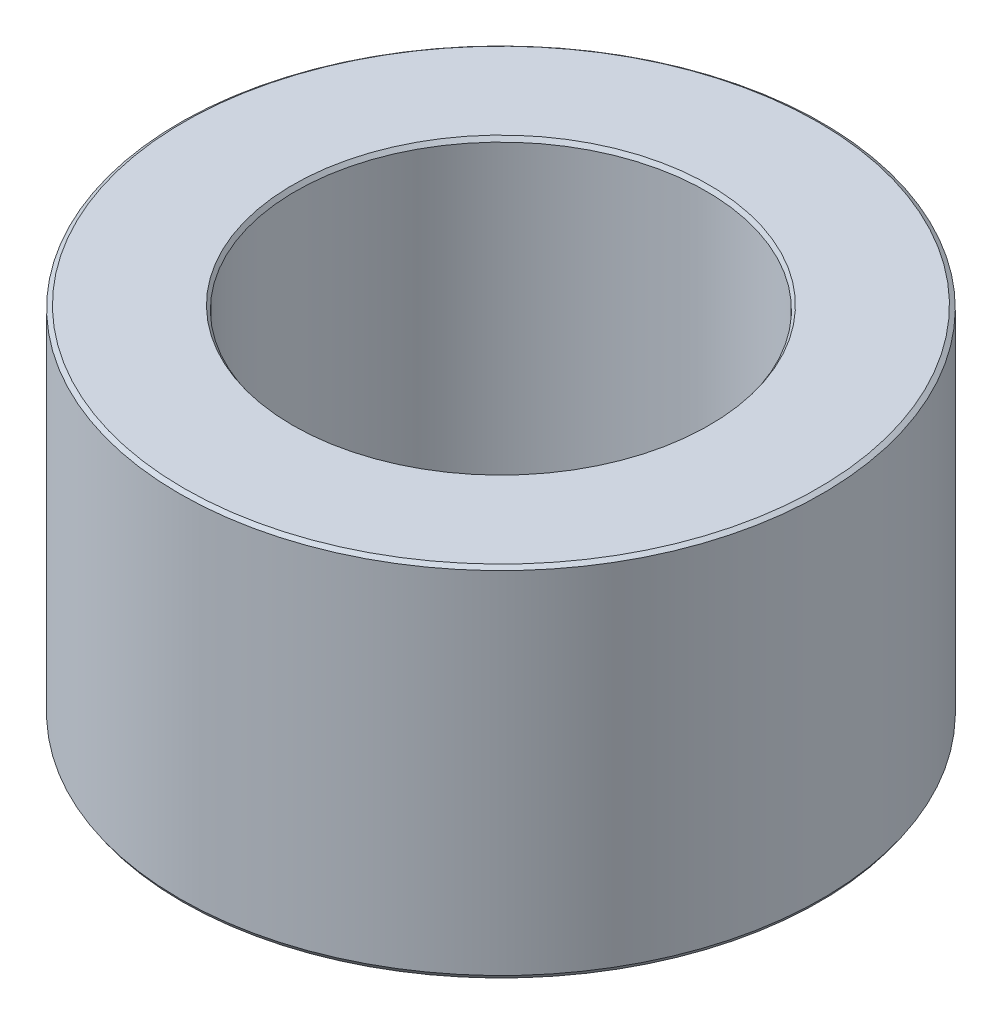
ISO-10303-21;
HEADER;
FILE_DESCRIPTION(('STEP AP214'),'2;1');
FILE_NAME('part.step','',(''),(''),'','','');
FILE_SCHEMA(('AUTOMOTIVE_DESIGN { 1 0 10303 214 1 1 1 1 }'));
ENDSEC;
DATA;
#1=APPLICATION_CONTEXT('core data for automotive mechanical design processes');
#2=APPLICATION_PROTOCOL_DEFINITION('international standard','automotive_design',2000,#1);
#3=PRODUCT_CONTEXT('',#1,'mechanical');
#4=PRODUCT('Part','Part','',(#3));
#5=PRODUCT_RELATED_PRODUCT_CATEGORY('part','',(#4));
#6=PRODUCT_DEFINITION_FORMATION('','',#4);
#7=PRODUCT_DEFINITION_CONTEXT('part definition',#1,'design');
#8=PRODUCT_DEFINITION('design','',#6,#7);
#9=PRODUCT_DEFINITION_SHAPE('','',#8);
#10=(LENGTH_UNIT() NAMED_UNIT(*) SI_UNIT(.MILLI.,.METRE.));
#11=(NAMED_UNIT(*) PLANE_ANGLE_UNIT() SI_UNIT($,.RADIAN.));
#12=(NAMED_UNIT(*) SI_UNIT($,.STERADIAN.) SOLID_ANGLE_UNIT());
#13=UNCERTAINTY_MEASURE_WITH_UNIT(LENGTH_MEASURE(1.E-05),#10,'distance_accuracy_value','');
#14=(GEOMETRIC_REPRESENTATION_CONTEXT(3) GLOBAL_UNCERTAINTY_ASSIGNED_CONTEXT((#13)) GLOBAL_UNIT_ASSIGNED_CONTEXT((#10,
#11,#12)) REPRESENTATION_CONTEXT('',''));
#15=CARTESIAN_POINT('',(0.,0.,0.));
#16=DIRECTION('',(0.,0.,1.));
#17=DIRECTION('',(1.,0.,0.));
#18=AXIS2_PLACEMENT_3D('',#15,#16,#17);
#19=CARTESIAN_POINT('',(0.,47.2960561947709,0.));
#20=DIRECTION('',(0.,-1.,0.));
#21=DIRECTION('',(0.,0.,-1.));
#22=AXIS2_PLACEMENT_3D('',#19,#20,#21);
#23=CYLINDRICAL_SURFACE('',#22,42.5);
#24=CARTESIAN_POINT('',(0.,0.544720812228144,0.));
#25=DIRECTION('',(0.,1.,0.));
#26=DIRECTION('',(0.,0.,1.));
#27=AXIS2_PLACEMENT_3D('',#24,#25,#26);
#28=CIRCLE('',#27,42.5);
#29=CARTESIAN_POINT('',(0.,0.544720812228144,42.5));
#30=VERTEX_POINT('',#29);
#31=EDGE_CURVE('E10',#30,#30,#28,.T.);
#32=ORIENTED_EDGE('',*,*,#31,.T.);
#33=EDGE_LOOP('',(#32));
#34=FACE_BOUND('',#33,.T.);
#35=CARTESIAN_POINT('',(0.,46.9309509189204,0.));
#36=DIRECTION('',(0.,1.,0.));
#37=DIRECTION('',(0.,0.,1.));
#38=AXIS2_PLACEMENT_3D('',#35,#36,#37);
#39=CIRCLE('',#38,42.5);
#40=CARTESIAN_POINT('',(0.,46.9309509189204,42.5));
#41=VERTEX_POINT('',#40);
#42=EDGE_CURVE('E50',#41,#41,#39,.F.);
#43=ORIENTED_EDGE('',*,*,#42,.T.);
#44=EDGE_LOOP('',(#43));
#45=FACE_BOUND('',#44,.T.);
#46=ADVANCED_FACE('F39',(#34,#45),#23,.T.);
#47=CARTESIAN_POINT('',(0.,47.2960561947709,0.));
#48=DIRECTION('',(0.,1.,0.));
#49=DIRECTION('',(0.,0.,1.));
#50=AXIS2_PLACEMENT_3D('',#47,#48,#49);
#51=PLANE('',#50);
#52=CARTESIAN_POINT('',(0.,47.2960561947709,0.));
#53=DIRECTION('',(0.,1.,0.));
#54=DIRECTION('',(0.,0.,1.));
#55=AXIS2_PLACEMENT_3D('',#52,#53,#54);
#56=CIRCLE('',#55,27.5468659009461);
#57=CARTESIAN_POINT('',(0.,47.2960561947709,27.5468659009461));
#58=VERTEX_POINT('',#57);
#59=EDGE_CURVE('E58',#58,#58,#56,.F.);
#60=ORIENTED_EDGE('',*,*,#59,.T.);
#61=EDGE_LOOP('',(#60));
#62=FACE_BOUND('',#61,.T.);
#63=CARTESIAN_POINT('',(0.,47.2960561947709,0.));
#64=DIRECTION('',(0.,1.,0.));
#65=DIRECTION('',(0.,0.,1.));
#66=AXIS2_PLACEMENT_3D('',#63,#64,#65);
#67=CIRCLE('',#66,41.9552791877718);
#68=CARTESIAN_POINT('',(0.,47.2960561947709,41.9552791877718));
#69=VERTEX_POINT('',#68);
#70=EDGE_CURVE('E61',#69,#69,#67,.T.);
#71=ORIENTED_EDGE('',*,*,#70,.T.);
#72=EDGE_LOOP('',(#71));
#73=FACE_BOUND('',#72,.T.);
#74=ADVANCED_FACE('F88',(#62,#73),#51,.T.);
#75=CARTESIAN_POINT('',(0.,0.,0.));
#76=DIRECTION('',(0.,1.,0.));
#77=DIRECTION('',(0.,0.,1.));
#78=AXIS2_PLACEMENT_3D('',#75,#76,#77);
#79=PLANE('',#78);
#80=CARTESIAN_POINT('',(0.,0.,0.));
#81=DIRECTION('',(0.,1.,0.));
#82=DIRECTION('',(0.,0.,1.));
#83=AXIS2_PLACEMENT_3D('',#80,#81,#82);
#84=CIRCLE('',#83,27.7264814373238);
#85=CARTESIAN_POINT('',(0.,0.,27.7264814373238));
#86=VERTEX_POINT('',#85);
#87=EDGE_CURVE('E51',#86,#86,#84,.T.);
#88=ORIENTED_EDGE('',*,*,#87,.T.);
#89=EDGE_LOOP('',(#88));
#90=FACE_BOUND('',#89,.T.);
#91=CARTESIAN_POINT('',(0.,0.,0.));
#92=DIRECTION('',(0.,1.,0.));
#93=DIRECTION('',(0.,0.,1.));
#94=AXIS2_PLACEMENT_3D('',#91,#92,#93);
#95=CIRCLE('',#94,42.1348947241495);
#96=CARTESIAN_POINT('',(0.,0.,42.1348947241495));
#97=VERTEX_POINT('',#96);
#98=EDGE_CURVE('E54',#97,#97,#95,.F.);
#99=ORIENTED_EDGE('',*,*,#98,.T.);
#100=EDGE_LOOP('',(#99));
#101=FACE_BOUND('',#100,.T.);
#102=ADVANCED_FACE('F83',(#90,#101),#79,.F.);
#103=CARTESIAN_POINT('',(0.,47.2960561947709,0.));
#104=DIRECTION('',(0.,-1.,0.));
#105=DIRECTION('',(0.,0.,-1.));
#106=AXIS2_PLACEMENT_3D('',#103,#104,#105);
#107=CYLINDRICAL_SURFACE('',#106,27.1817606250956);
#108=CARTESIAN_POINT('',(0.,46.7513353825428,0.));
#109=DIRECTION('',(0.,1.,0.));
#110=DIRECTION('',(0.,0.,1.));
#111=AXIS2_PLACEMENT_3D('',#108,#109,#110);
#112=CIRCLE('',#111,27.1817606250956);
#113=CARTESIAN_POINT('',(0.,46.7513353825428,27.1817606250956));
#114=VERTEX_POINT('',#113);
#115=EDGE_CURVE('E67',#114,#114,#112,.T.);
#116=ORIENTED_EDGE('',*,*,#115,.T.);
#117=EDGE_LOOP('',(#116));
#118=FACE_BOUND('',#117,.T.);
#119=CARTESIAN_POINT('',(0.,0.3651052758505,0.));
#120=DIRECTION('',(0.,1.,0.));
#121=DIRECTION('',(0.,0.,1.));
#122=AXIS2_PLACEMENT_3D('',#119,#120,#121);
#123=CIRCLE('',#122,27.1817606250956);
#124=CARTESIAN_POINT('',(0.,0.3651052758505,27.1817606250956));
#125=VERTEX_POINT('',#124);
#126=EDGE_CURVE('E69',#125,#125,#123,.F.);
#127=ORIENTED_EDGE('',*,*,#126,.T.);
#128=EDGE_LOOP('',(#127));
#129=FACE_BOUND('',#128,.T.);
#130=ADVANCED_FACE('F71',(#118,#129),#107,.F.);
#131=CARTESIAN_POINT('',(0.,46.7513353825428,0.));
#132=DIRECTION('',(0.,1.,0.));
#133=DIRECTION('',(0.,0.,1.));
#134=AXIS2_PLACEMENT_3D('',#131,#132,#133);
#135=CONICAL_SURFACE('',#134,27.1817606250956,0.590487063925785);
#136=ORIENTED_EDGE('',*,*,#59,.F.);
#137=EDGE_LOOP('',(#136));
#138=FACE_BOUND('',#137,.T.);
#139=ORIENTED_EDGE('',*,*,#115,.F.);
#140=EDGE_LOOP('',(#139));
#141=FACE_BOUND('',#140,.T.);
#142=ADVANCED_FACE('F77',(#138,#141),#135,.F.);
#143=CARTESIAN_POINT('',(0.,0.,0.));
#144=DIRECTION('',(0.,-1.,0.));
#145=DIRECTION('',(0.,0.,-1.));
#146=AXIS2_PLACEMENT_3D('',#143,#144,#145);
#147=CONICAL_SURFACE('',#146,27.7264814373238,0.980309262869125);
#148=ORIENTED_EDGE('',*,*,#126,.F.);
#149=EDGE_LOOP('',(#148));
#150=FACE_BOUND('',#149,.T.);
#151=ORIENTED_EDGE('',*,*,#87,.F.);
#152=EDGE_LOOP('',(#151));
#153=FACE_BOUND('',#152,.T.);
#154=ADVANCED_FACE('F73',(#150,#153),#147,.F.);
#155=CARTESIAN_POINT('',(0.,0.544720812228144,0.));
#156=DIRECTION('',(0.,1.,0.));
#157=DIRECTION('',(0.,0.,1.));
#158=AXIS2_PLACEMENT_3D('',#155,#156,#157);
#159=CONICAL_SURFACE('',#158,42.5,0.590487063925775);
#160=CARTESIAN_POINT('',(0.,0.,42.1348947241495));
#161=CARTESIAN_POINT('',(0.,0.00567417512737789,42.1386979041063));
#162=CARTESIAN_POINT('',(0.,0.0113483502547539,42.1425010840631));
#163=CARTESIAN_POINT('',(0.,0.022696700509506,42.1501074439766));
#164=CARTESIAN_POINT('',(0.,0.028370875636882,42.1539106239334));
#165=CARTESIAN_POINT('',(0.,0.0397192258916348,42.1615169838469));
#166=CARTESIAN_POINT('',(0.,0.0453934010190116,42.1653201638037));
#167=CARTESIAN_POINT('',(0.,0.0567417512737653,42.1729265237173));
#168=CARTESIAN_POINT('',(0.,0.0624159264011421,42.176729703674));
#169=CARTESIAN_POINT('',(0.,0.0737642766558947,42.1843360635876));
#170=CARTESIAN_POINT('',(0.,0.0794384517832705,42.1881392435444));
#171=CARTESIAN_POINT('',(0.,0.0907868020380232,42.1957456034579));
#172=CARTESIAN_POINT('',(0.,0.0964609771654003,42.1995487834147));
#173=CARTESIAN_POINT('',(0.,0.107809327420154,42.2071551433283));
#174=CARTESIAN_POINT('',(0.,0.11348350254753,42.210958323285));
#175=CARTESIAN_POINT('',(0.,0.124831852802283,42.2185646831986));
#176=CARTESIAN_POINT('',(0.,0.13050602792966,42.2223678631554));
#177=CARTESIAN_POINT('',(0.,0.141854378184413,42.2299742230689));
#178=CARTESIAN_POINT('',(0.,0.147528553311789,42.2337774030257));
#179=CARTESIAN_POINT('',(0.,0.158876903566541,42.2413837629392));
#180=CARTESIAN_POINT('',(0.,0.164551078693918,42.245186942896));
#181=CARTESIAN_POINT('',(0.,0.175899428948672,42.2527933028096));
#182=CARTESIAN_POINT('',(0.,0.181573604076049,42.2565964827663));
#183=CARTESIAN_POINT('',(0.,0.192921954330801,42.2642028426799));
#184=CARTESIAN_POINT('',(0.,0.198596129458177,42.2680060226367));
#185=CARTESIAN_POINT('',(0.,0.20994447971293,42.2756123825502));
#186=CARTESIAN_POINT('',(0.,0.215618654840307,42.279415562507));
#187=CARTESIAN_POINT('',(0.,0.22696700509506,42.2870219224205));
#188=CARTESIAN_POINT('',(0.,0.232641180222437,42.2908251023773));
#189=CARTESIAN_POINT('',(0.,0.24398953047719,42.2984314622909));
#190=CARTESIAN_POINT('',(0.,0.249663705604566,42.3022346422477));
#191=CARTESIAN_POINT('',(0.,0.261012055859318,42.3098410021612));
#192=CARTESIAN_POINT('',(0.,0.266686230986695,42.313644182118));
#193=CARTESIAN_POINT('',(0.,0.278034581241449,42.3212505420315));
#194=CARTESIAN_POINT('',(0.,0.283708756368826,42.3250537219883));
#195=CARTESIAN_POINT('',(0.,0.295057106623578,42.3326600819019));
#196=CARTESIAN_POINT('',(0.,0.300731281750954,42.3364632618586));
#197=CARTESIAN_POINT('',(0.,0.312079632005707,42.3440696217722));
#198=CARTESIAN_POINT('',(0.,0.317753807133084,42.347872801729));
#199=CARTESIAN_POINT('',(0.,0.329102157387837,42.3554791616425));
#200=CARTESIAN_POINT('',(0.,0.334776332515214,42.3592823415993));
#201=CARTESIAN_POINT('',(0.,0.346124682769967,42.3668887015128));
#202=CARTESIAN_POINT('',(0.,0.351798857897343,42.3706918814696));
#203=CARTESIAN_POINT('',(0.,0.363147208152096,42.3782982413832));
#204=CARTESIAN_POINT('',(0.,0.368821383279473,42.38210142134));
#205=CARTESIAN_POINT('',(0.,0.380169733534226,42.3897077812535));
#206=CARTESIAN_POINT('',(0.,0.385843908661602,42.3935109612103));
#207=CARTESIAN_POINT('',(0.,0.397192258916355,42.4011173211238));
#208=CARTESIAN_POINT('',(0.,0.402866434043732,42.4049205010806));
#209=CARTESIAN_POINT('',(0.,0.414214784298485,42.4125268609942));
#210=CARTESIAN_POINT('',(0.,0.419888959425861,42.4163300409509));
#211=CARTESIAN_POINT('',(0.,0.431237309680613,42.4239364008645));
#212=CARTESIAN_POINT('',(0.,0.43691148480799,42.4277395808213));
#213=CARTESIAN_POINT('',(0.,0.448259835062744,42.4353459407348));
#214=CARTESIAN_POINT('',(0.,0.453934010190121,42.4391491206916));
#215=CARTESIAN_POINT('',(0.,0.465282360444874,42.4467554806051));
#216=CARTESIAN_POINT('',(0.,0.470956535572249,42.4505586605619));
#217=CARTESIAN_POINT('',(0.,0.482304885827002,42.4581650204755));
#218=CARTESIAN_POINT('',(0.,0.487979060954379,42.4619682004323));
#219=CARTESIAN_POINT('',(0.,0.499327411209133,42.4695745603458));
#220=CARTESIAN_POINT('',(0.,0.505001586336509,42.4733777403026));
#221=CARTESIAN_POINT('',(0.,0.516349936591262,42.4809841002161));
#222=CARTESIAN_POINT('',(0.,0.522024111718638,42.4847872801729));
#223=CARTESIAN_POINT('',(0.,0.53337246197339,42.4923936400865));
#224=CARTESIAN_POINT('',(0.,0.539046637100766,42.4961968200432));
#225=CARTESIAN_POINT('',(0.,0.544720812228144,42.5));
#226=B_SPLINE_CURVE_WITH_KNOTS('',3,(#160,#161,#162,#163,#164,#165,#166,#167,#168,#169,#170,
#171,#172,#173,#174,#175,#176,#177,#178,#179,#180,#181,#182,#183,#184,#185,#186,#187,#188,#189,
#190,#191,#192,#193,#194,#195,#196,#197,#198,#199,#200,#201,#202,#203,#204,#205,#206,#207,#208,
#209,#210,#211,#212,#213,#214,#215,#216,#217,#218,#219,#220,#221,#222,#223,#224,#225),
.UNSPECIFIED.,.F.,.F.,(4,2,2,2,2,2,2,2,2,2,2,2,2,2,2,2,2,2,2,2,2,2,2,2,2,2,2,2,2,2,2,2,4),(0.,
0.0204925345049801,0.0409850690099641,0.0614776035149442,0.0819701380199243,0.102462672524908,
0.122955207029888,0.143447741534869,0.163940276039849,0.184432810544833,0.204925345049813,
0.225417879554793,0.245910414059777,0.266402948564757,0.286895483069737,0.307388017574721,
0.327880552079701,0.348373086584682,0.368865621089665,0.389358155594646,0.409850690099626,
0.43034322460461,0.45083575910959,0.47132829361457,0.49182082811955,0.512313362624534,
0.532805897129514,0.553298431634494,0.573790966139478,0.594283500644458,0.614776035149439,
0.635268569654422,0.655761104159403),.UNSPECIFIED.);
#227=EDGE_CURVE('BSEAM76',#97,#30,#226,.T.);
#228=ORIENTED_EDGE('',*,*,#98,.F.);
#229=ORIENTED_EDGE('',*,*,#31,.F.);
#230=ORIENTED_EDGE('',*,*,#227,.T.);
#231=ORIENTED_EDGE('',*,*,#227,.F.);
#232=EDGE_LOOP('',(#228,#230,#229,#231));
#233=FACE_BOUND('',#232,.T.);
#234=ADVANCED_FACE('F76',(#233),#159,.T.);
#235=CARTESIAN_POINT('',(0.,47.2960561947709,0.));
#236=DIRECTION('',(0.,-1.,0.));
#237=DIRECTION('',(0.,0.,-1.));
#238=AXIS2_PLACEMENT_3D('',#235,#236,#237);
#239=CONICAL_SURFACE('',#238,41.9552791877718,0.980309262869134);
#240=ORIENTED_EDGE('',*,*,#42,.F.);
#241=EDGE_LOOP('',(#240));
#242=FACE_BOUND('',#241,.T.);
#243=ORIENTED_EDGE('',*,*,#70,.F.);
#244=EDGE_LOOP('',(#243));
#245=FACE_BOUND('',#244,.T.);
#246=ADVANCED_FACE('F45',(#242,#245),#239,.T.);
#247=CLOSED_SHELL('',(#46,#74,#102,#130,#142,#154,#234,#246));
#248=MANIFOLD_SOLID_BREP('B2',#247);
#249=ADVANCED_BREP_SHAPE_REPRESENTATION('',(#18,#248),#14);
#250=SHAPE_DEFINITION_REPRESENTATION(#9,#249);
ENDSEC;
END-ISO-10303-21;
